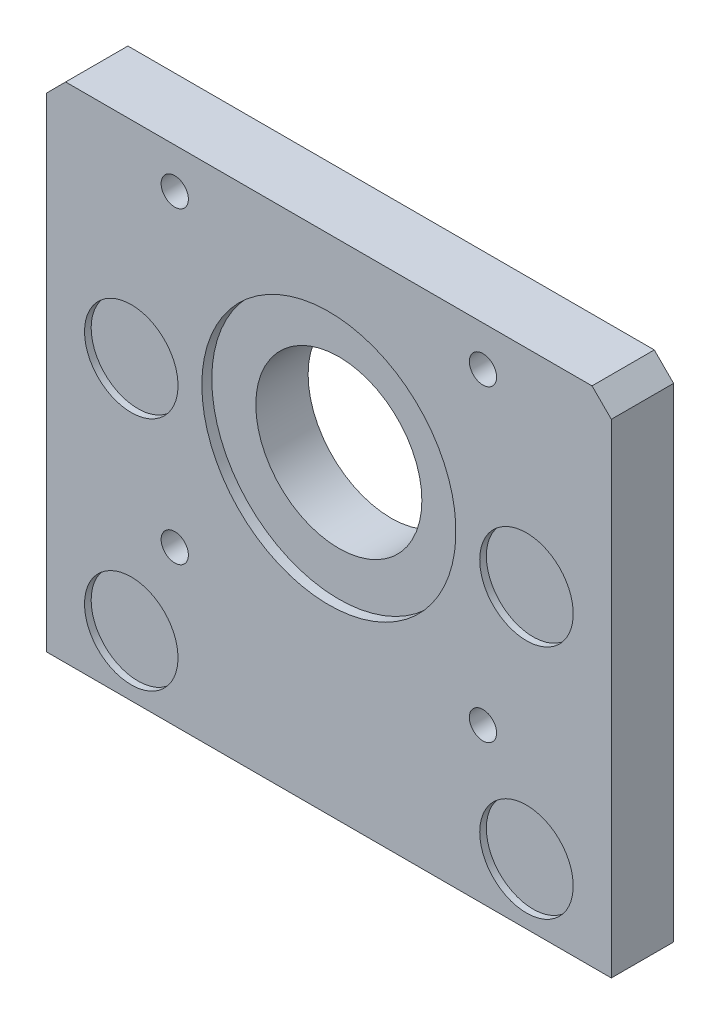
ISO-10303-21;
HEADER;
FILE_DESCRIPTION(('STEP AP214'),'2;1');
FILE_NAME('part.step','',(''),(''),'','','');
FILE_SCHEMA(('AUTOMOTIVE_DESIGN { 1 0 10303 214 1 1 1 1 }'));
ENDSEC;
DATA;
#1=APPLICATION_CONTEXT('core data for automotive mechanical design processes');
#2=APPLICATION_PROTOCOL_DEFINITION('international standard','automotive_design',2000,#1);
#3=PRODUCT_CONTEXT('',#1,'mechanical');
#4=PRODUCT('Part','Part','',(#3));
#5=PRODUCT_RELATED_PRODUCT_CATEGORY('part','',(#4));
#6=PRODUCT_DEFINITION_FORMATION('','',#4);
#7=PRODUCT_DEFINITION_CONTEXT('part definition',#1,'design');
#8=PRODUCT_DEFINITION('design','',#6,#7);
#9=PRODUCT_DEFINITION_SHAPE('','',#8);
#10=(LENGTH_UNIT() NAMED_UNIT(*) SI_UNIT(.MILLI.,.METRE.));
#11=(NAMED_UNIT(*) PLANE_ANGLE_UNIT() SI_UNIT($,.RADIAN.));
#12=(NAMED_UNIT(*) SI_UNIT($,.STERADIAN.) SOLID_ANGLE_UNIT());
#13=UNCERTAINTY_MEASURE_WITH_UNIT(LENGTH_MEASURE(1.E-05),#10,'distance_accuracy_value','');
#14=(GEOMETRIC_REPRESENTATION_CONTEXT(3) GLOBAL_UNCERTAINTY_ASSIGNED_CONTEXT((#13)) GLOBAL_UNIT_ASSIGNED_CONTEXT((#10,
#11,#12)) REPRESENTATION_CONTEXT('',''));
#15=CARTESIAN_POINT('',(0.,0.,0.));
#16=DIRECTION('',(0.,0.,1.));
#17=DIRECTION('',(1.,0.,0.));
#18=AXIS2_PLACEMENT_3D('',#15,#16,#17);
#19=CARTESIAN_POINT('',(30.226001739502,-18.0340015888214,8.509));
#20=DIRECTION('',(0.,0.,1.));
#21=DIRECTION('',(1.,0.,0.));
#22=AXIS2_PLACEMENT_3D('',#19,#20,#21);
#23=PLANE('',#22);
#24=CARTESIAN_POINT('',(30.226001739502,-18.0340015888214,8.509));
#25=DIRECTION('',(0.,0.,-1.));
#26=DIRECTION('',(-1.,0.,0.));
#27=AXIS2_PLACEMENT_3D('',#24,#25,#26);
#28=CIRCLE('',#27,7.1501);
#29=CARTESIAN_POINT('',(23.075901739502,-18.0340015888214,8.509));
#30=VERTEX_POINT('',#29);
#31=EDGE_CURVE('E19',#30,#30,#28,.F.);
#32=ORIENTED_EDGE('',*,*,#31,.T.);
#33=EDGE_LOOP('',(#32));
#34=FACE_BOUND('',#33,.T.);
#35=ADVANCED_FACE('F16',(#34),#23,.T.);
#36=CARTESIAN_POINT('',(30.226001739502,18.0340015888214,8.509));
#37=DIRECTION('',(0.,0.,1.));
#38=DIRECTION('',(1.,0.,0.));
#39=AXIS2_PLACEMENT_3D('',#36,#37,#38);
#40=PLANE('',#39);
#41=CARTESIAN_POINT('',(30.226001739502,18.0340015888214,8.509));
#42=DIRECTION('',(0.,0.,-1.));
#43=DIRECTION('',(-1.,0.,0.));
#44=AXIS2_PLACEMENT_3D('',#41,#42,#43);
#45=CIRCLE('',#44,7.1501);
#46=CARTESIAN_POINT('',(23.075901739502,18.0340015888214,8.509));
#47=VERTEX_POINT('',#46);
#48=EDGE_CURVE('E151',#47,#47,#45,.F.);
#49=ORIENTED_EDGE('',*,*,#48,.T.);
#50=EDGE_LOOP('',(#49));
#51=FACE_BOUND('',#50,.T.);
#52=ADVANCED_FACE('F245',(#51),#40,.T.);
#53=CARTESIAN_POINT('',(-30.2260023359813,-18.0340010436572,8.509));
#54=DIRECTION('',(0.,0.,1.));
#55=DIRECTION('',(1.,0.,0.));
#56=AXIS2_PLACEMENT_3D('',#53,#54,#55);
#57=PLANE('',#56);
#58=CARTESIAN_POINT('',(-30.2260023359813,-18.0340010436572,8.509));
#59=DIRECTION('',(0.,0.,-1.));
#60=DIRECTION('',(-1.,0.,0.));
#61=AXIS2_PLACEMENT_3D('',#58,#59,#60);
#62=CIRCLE('',#61,7.1501);
#63=CARTESIAN_POINT('',(-37.3761023359813,-18.0340010436572,8.509));
#64=VERTEX_POINT('',#63);
#65=EDGE_CURVE('E149',#64,#64,#62,.F.);
#66=ORIENTED_EDGE('',*,*,#65,.T.);
#67=EDGE_LOOP('',(#66));
#68=FACE_BOUND('',#67,.T.);
#69=ADVANCED_FACE('F243',(#68),#57,.T.);
#70=CARTESIAN_POINT('',(-30.2260023359813,18.0340010436575,8.509));
#71=DIRECTION('',(0.,0.,1.));
#72=DIRECTION('',(1.,0.,0.));
#73=AXIS2_PLACEMENT_3D('',#70,#71,#72);
#74=PLANE('',#73);
#75=CARTESIAN_POINT('',(-30.2260023359813,18.0340010436575,8.509));
#76=DIRECTION('',(0.,0.,-1.));
#77=DIRECTION('',(-1.,0.,0.));
#78=AXIS2_PLACEMENT_3D('',#75,#76,#77);
#79=CIRCLE('',#78,7.1501);
#80=CARTESIAN_POINT('',(-37.3761023359813,18.0340010436575,8.509));
#81=VERTEX_POINT('',#80);
#82=EDGE_CURVE('E146',#81,#81,#79,.F.);
#83=ORIENTED_EDGE('',*,*,#82,.T.);
#84=EDGE_LOOP('',(#83));
#85=FACE_BOUND('',#84,.T.);
#86=ADVANCED_FACE('F173',(#85),#74,.T.);
#87=CARTESIAN_POINT('',(0.,19.9408457428421,9.525));
#88=DIRECTION('',(0.,0.,-1.));
#89=DIRECTION('',(-1.,0.,0.));
#90=AXIS2_PLACEMENT_3D('',#87,#88,#89);
#91=CYLINDRICAL_SURFACE('',#90,19.431);
#92=CARTESIAN_POINT('',(0.,19.9408457428421,9.525));
#93=DIRECTION('',(0.,0.,-1.));
#94=DIRECTION('',(-1.,0.,0.));
#95=AXIS2_PLACEMENT_3D('',#92,#93,#94);
#96=CIRCLE('',#95,19.431);
#97=CARTESIAN_POINT('',(-19.431,19.9408457428421,9.525));
#98=VERTEX_POINT('',#97);
#99=EDGE_CURVE('E140',#98,#98,#96,.T.);
#100=ORIENTED_EDGE('',*,*,#99,.F.);
#101=EDGE_LOOP('',(#100));
#102=FACE_BOUND('',#101,.T.);
#103=CARTESIAN_POINT('',(0.,19.9408457428421,8.001));
#104=DIRECTION('',(0.,0.,-1.));
#105=DIRECTION('',(-1.,0.,0.));
#106=AXIS2_PLACEMENT_3D('',#103,#104,#105);
#107=CIRCLE('',#106,19.431);
#108=CARTESIAN_POINT('',(-19.431,19.9408457428421,8.001));
#109=VERTEX_POINT('',#108);
#110=EDGE_CURVE('E143',#109,#109,#107,.T.);
#111=ORIENTED_EDGE('',*,*,#110,.T.);
#112=EDGE_LOOP('',(#111));
#113=FACE_BOUND('',#112,.T.);
#114=ADVANCED_FACE('F162',(#102,#113),#91,.F.);
#115=CARTESIAN_POINT('',(30.226001739502,-18.0340015888214,9.525));
#116=DIRECTION('',(0.,0.,-1.));
#117=DIRECTION('',(-1.,0.,0.));
#118=AXIS2_PLACEMENT_3D('',#115,#116,#117);
#119=CYLINDRICAL_SURFACE('',#118,7.1501);
#120=CARTESIAN_POINT('',(30.226001739502,-18.0340015888214,9.525));
#121=DIRECTION('',(0.,0.,-1.));
#122=DIRECTION('',(-1.,0.,0.));
#123=AXIS2_PLACEMENT_3D('',#120,#121,#122);
#124=CIRCLE('',#123,7.1501);
#125=CARTESIAN_POINT('',(23.075901739502,-18.0340015888214,9.525));
#126=VERTEX_POINT('',#125);
#127=EDGE_CURVE('E137',#126,#126,#124,.T.);
#128=ORIENTED_EDGE('',*,*,#127,.F.);
#129=EDGE_LOOP('',(#128));
#130=FACE_BOUND('',#129,.T.);
#131=ORIENTED_EDGE('',*,*,#31,.F.);
#132=EDGE_LOOP('',(#131));
#133=FACE_BOUND('',#132,.T.);
#134=ADVANCED_FACE('F159',(#130,#133),#119,.F.);
#135=CARTESIAN_POINT('',(30.226001739502,18.0340015888214,9.525));
#136=DIRECTION('',(0.,0.,-1.));
#137=DIRECTION('',(-1.,0.,0.));
#138=AXIS2_PLACEMENT_3D('',#135,#136,#137);
#139=CYLINDRICAL_SURFACE('',#138,7.1501);
#140=CARTESIAN_POINT('',(30.226001739502,18.0340015888214,9.525));
#141=DIRECTION('',(0.,0.,-1.));
#142=DIRECTION('',(-1.,0.,0.));
#143=AXIS2_PLACEMENT_3D('',#140,#141,#142);
#144=CIRCLE('',#143,7.1501);
#145=CARTESIAN_POINT('',(23.075901739502,18.0340015888214,9.525));
#146=VERTEX_POINT('',#145);
#147=EDGE_CURVE('E134',#146,#146,#144,.T.);
#148=ORIENTED_EDGE('',*,*,#147,.F.);
#149=EDGE_LOOP('',(#148));
#150=FACE_BOUND('',#149,.T.);
#151=ORIENTED_EDGE('',*,*,#48,.F.);
#152=EDGE_LOOP('',(#151));
#153=FACE_BOUND('',#152,.T.);
#154=ADVANCED_FACE('F161',(#150,#153),#139,.F.);
#155=CARTESIAN_POINT('',(-30.2260023359813,-18.0340010436572,9.525));
#156=DIRECTION('',(0.,0.,-1.));
#157=DIRECTION('',(-1.,0.,0.));
#158=AXIS2_PLACEMENT_3D('',#155,#156,#157);
#159=CYLINDRICAL_SURFACE('',#158,7.1501);
#160=CARTESIAN_POINT('',(-30.2260023359813,-18.0340010436572,9.525));
#161=DIRECTION('',(0.,0.,-1.));
#162=DIRECTION('',(-1.,0.,0.));
#163=AXIS2_PLACEMENT_3D('',#160,#161,#162);
#164=CIRCLE('',#163,7.1501);
#165=CARTESIAN_POINT('',(-37.3761023359813,-18.0340010436572,9.525));
#166=VERTEX_POINT('',#165);
#167=EDGE_CURVE('E131',#166,#166,#164,.T.);
#168=ORIENTED_EDGE('',*,*,#167,.F.);
#169=EDGE_LOOP('',(#168));
#170=FACE_BOUND('',#169,.T.);
#171=ORIENTED_EDGE('',*,*,#65,.F.);
#172=EDGE_LOOP('',(#171));
#173=FACE_BOUND('',#172,.T.);
#174=ADVANCED_FACE('F170',(#170,#173),#159,.F.);
#175=CARTESIAN_POINT('',(-30.2260023359813,18.0340010436575,9.525));
#176=DIRECTION('',(0.,0.,-1.));
#177=DIRECTION('',(-1.,0.,0.));
#178=AXIS2_PLACEMENT_3D('',#175,#176,#177);
#179=CYLINDRICAL_SURFACE('',#178,7.1501);
#180=CARTESIAN_POINT('',(-30.2260023359813,18.0340010436575,9.525));
#181=DIRECTION('',(0.,0.,-1.));
#182=DIRECTION('',(-1.,0.,0.));
#183=AXIS2_PLACEMENT_3D('',#180,#181,#182);
#184=CIRCLE('',#183,7.1501);
#185=CARTESIAN_POINT('',(-37.3761023359813,18.0340010436575,9.525));
#186=VERTEX_POINT('',#185);
#187=EDGE_CURVE('E128',#186,#186,#184,.T.);
#188=ORIENTED_EDGE('',*,*,#187,.F.);
#189=EDGE_LOOP('',(#188));
#190=FACE_BOUND('',#189,.T.);
#191=ORIENTED_EDGE('',*,*,#82,.F.);
#192=EDGE_LOOP('',(#191));
#193=FACE_BOUND('',#192,.T.);
#194=ADVANCED_FACE('F230',(#190,#193),#179,.F.);
#195=CARTESIAN_POINT('',(0.,19.9408457428421,8.001));
#196=DIRECTION('',(0.,0.,-1.));
#197=DIRECTION('',(-1.,0.,0.));
#198=AXIS2_PLACEMENT_3D('',#195,#196,#197);
#199=PLANE('',#198);
#200=ORIENTED_EDGE('',*,*,#110,.F.);
#201=EDGE_LOOP('',(#200));
#202=FACE_BOUND('',#201,.T.);
#203=CARTESIAN_POINT('',(0.,19.9408457428421,8.001));
#204=DIRECTION('',(0.,0.,-1.));
#205=DIRECTION('',(-1.,0.,0.));
#206=AXIS2_PLACEMENT_3D('',#203,#204,#205);
#207=CIRCLE('',#206,12.7);
#208=CARTESIAN_POINT('',(-12.7,19.9408457428421,8.001));
#209=VERTEX_POINT('',#208);
#210=EDGE_CURVE('E89',#209,#209,#207,.T.);
#211=ORIENTED_EDGE('',*,*,#210,.T.);
#212=EDGE_LOOP('',(#211));
#213=FACE_BOUND('',#212,.T.);
#214=ADVANCED_FACE('F226',(#202,#213),#199,.F.);
#215=CARTESIAN_POINT('',(-0.00046993841071194,10.755760059879,9.525));
#216=DIRECTION('',(0.,0.,1.));
#217=DIRECTION('',(1.,0.,0.));
#218=AXIS2_PLACEMENT_3D('',#215,#216,#217);
#219=PLANE('',#218);
#220=ORIENTED_EDGE('',*,*,#187,.T.);
#221=EDGE_LOOP('',(#220));
#222=FACE_BOUND('',#221,.T.);
#223=ORIENTED_EDGE('',*,*,#167,.T.);
#224=EDGE_LOOP('',(#223));
#225=FACE_BOUND('',#224,.T.);
#226=ORIENTED_EDGE('',*,*,#147,.T.);
#227=EDGE_LOOP('',(#226));
#228=FACE_BOUND('',#227,.T.);
#229=ORIENTED_EDGE('',*,*,#127,.T.);
#230=EDGE_LOOP('',(#229));
#231=FACE_BOUND('',#230,.T.);
#232=DIRECTION('',(-0.705688297333315,-0.708522425196837,0.));
#233=VECTOR('',#232,1.);
#234=CARTESIAN_POINT('',(-43.2054,46.7072131003762,9.525));
#235=LINE('',#234,#233);
#236=CARTESIAN_POINT('',(-43.2054,46.7072131003762,9.525));
#237=VERTEX_POINT('',#236);
#238=CARTESIAN_POINT('',(-40.2649046888867,49.6595177892634,9.525));
#239=VERTEX_POINT('',#238);
#240=EDGE_CURVE('E65',#237,#239,#235,.F.);
#241=ORIENTED_EDGE('',*,*,#240,.F.);
#242=DIRECTION('',(0.,1.,0.));
#243=VECTOR('',#242,1.);
#244=CARTESIAN_POINT('',(-43.2054,-27.3031542571579,9.525));
#245=LINE('',#244,#243);
#246=CARTESIAN_POINT('',(-43.2054,-27.3031542571579,9.525));
#247=VERTEX_POINT('',#246);
#248=EDGE_CURVE('E447',#247,#237,#245,.T.);
#249=ORIENTED_EDGE('',*,*,#248,.F.);
#250=DIRECTION('',(1.,0.,0.));
#251=VECTOR('',#250,1.);
#252=CARTESIAN_POINT('',(43.2054,-27.3031542571579,9.525));
#253=LINE('',#252,#251);
#254=CARTESIAN_POINT('',(43.2054,-27.3031542571579,9.525));
#255=VERTEX_POINT('',#254);
#256=EDGE_CURVE('E444',#255,#247,#253,.F.);
#257=ORIENTED_EDGE('',*,*,#256,.F.);
#258=DIRECTION('',(0.,1.,0.));
#259=VECTOR('',#258,1.);
#260=CARTESIAN_POINT('',(43.2054,46.7072131003767,9.525));
#261=LINE('',#260,#259);
#262=CARTESIAN_POINT('',(43.2054,46.7072131003767,9.525));
#263=VERTEX_POINT('',#262);
#264=EDGE_CURVE('E85',#263,#255,#261,.F.);
#265=ORIENTED_EDGE('',*,*,#264,.F.);
#266=DIRECTION('',(-0.707106781186585,0.70710678118651,0.));
#267=VECTOR('',#266,1.);
#268=CARTESIAN_POINT('',(40.2530953111129,49.6595177892634,9.525));
#269=LINE('',#268,#267);
#270=CARTESIAN_POINT('',(40.2530953111129,49.6595177892634,9.525));
#271=VERTEX_POINT('',#270);
#272=EDGE_CURVE('E79',#271,#263,#269,.F.);
#273=ORIENTED_EDGE('',*,*,#272,.F.);
#274=DIRECTION('',(1.,0.,0.));
#275=VECTOR('',#274,1.);
#276=CARTESIAN_POINT('',(-40.2649046888867,49.6595177892634,9.525));
#277=LINE('',#276,#275);
#278=EDGE_CURVE('E70',#239,#271,#277,.T.);
#279=ORIENTED_EDGE('',*,*,#278,.F.);
#280=EDGE_LOOP('',(#241,#249,#257,#265,#273,#279));
#281=FACE_BOUND('',#280,.T.);
#282=ORIENTED_EDGE('',*,*,#99,.T.);
#283=EDGE_LOOP('',(#282));
#284=FACE_BOUND('',#283,.T.);
#285=CARTESIAN_POINT('',(23.5712,-3.63035425715801,9.525));
#286=DIRECTION('',(0.,0.,-1.));
#287=DIRECTION('',(-1.,0.,0.));
#288=AXIS2_PLACEMENT_3D('',#285,#286,#287);
#289=CIRCLE('',#288,2.0828);
#290=CARTESIAN_POINT('',(21.4884,-3.63035425715801,9.525));
#291=VERTEX_POINT('',#290);
#292=EDGE_CURVE('E116',#291,#291,#289,.T.);
#293=ORIENTED_EDGE('',*,*,#292,.T.);
#294=EDGE_LOOP('',(#293));
#295=FACE_BOUND('',#294,.T.);
#296=CARTESIAN_POINT('',(-23.5712,-3.63035425715801,9.525));
#297=DIRECTION('',(0.,0.,-1.));
#298=DIRECTION('',(-1.,0.,0.));
#299=AXIS2_PLACEMENT_3D('',#296,#297,#298);
#300=CIRCLE('',#299,2.0828);
#301=CARTESIAN_POINT('',(-25.654,-3.63035425715801,9.525));
#302=VERTEX_POINT('',#301);
#303=EDGE_CURVE('E119',#302,#302,#300,.T.);
#304=ORIENTED_EDGE('',*,*,#303,.T.);
#305=EDGE_LOOP('',(#304));
#306=FACE_BOUND('',#305,.T.);
#307=CARTESIAN_POINT('',(23.5712,43.512045742842,9.525));
#308=DIRECTION('',(0.,0.,-1.));
#309=DIRECTION('',(-1.,0.,0.));
#310=AXIS2_PLACEMENT_3D('',#307,#308,#309);
#311=CIRCLE('',#310,2.0828);
#312=CARTESIAN_POINT('',(21.4884,43.512045742842,9.525));
#313=VERTEX_POINT('',#312);
#314=EDGE_CURVE('E122',#313,#313,#311,.T.);
#315=ORIENTED_EDGE('',*,*,#314,.T.);
#316=EDGE_LOOP('',(#315));
#317=FACE_BOUND('',#316,.T.);
#318=CARTESIAN_POINT('',(-23.5712,43.512045742842,9.525));
#319=DIRECTION('',(0.,0.,-1.));
#320=DIRECTION('',(-1.,0.,0.));
#321=AXIS2_PLACEMENT_3D('',#318,#319,#320);
#322=CIRCLE('',#321,2.0828);
#323=CARTESIAN_POINT('',(-25.654,43.512045742842,9.525));
#324=VERTEX_POINT('',#323);
#325=EDGE_CURVE('E125',#324,#324,#322,.T.);
#326=ORIENTED_EDGE('',*,*,#325,.T.);
#327=EDGE_LOOP('',(#326));
#328=FACE_BOUND('',#327,.T.);
#329=ADVANCED_FACE('F82',(#222,#225,#228,#231,#281,#284,#295,#306,#317,#328),#219,.T.);
#330=CARTESIAN_POINT('',(-23.5712,43.512045742842,9.525));
#331=DIRECTION('',(0.,0.,-1.));
#332=DIRECTION('',(-1.,0.,0.));
#333=AXIS2_PLACEMENT_3D('',#330,#331,#332);
#334=CYLINDRICAL_SURFACE('',#333,2.0828);
#335=ORIENTED_EDGE('',*,*,#325,.F.);
#336=EDGE_LOOP('',(#335));
#337=FACE_BOUND('',#336,.T.);
#338=CARTESIAN_POINT('',(-23.5712,43.512045742842,0.));
#339=DIRECTION('',(0.,0.,-1.));
#340=DIRECTION('',(-1.,0.,0.));
#341=AXIS2_PLACEMENT_3D('',#338,#339,#340);
#342=CIRCLE('',#341,2.0828);
#343=CARTESIAN_POINT('',(-25.654,43.512045742842,0.));
#344=VERTEX_POINT('',#343);
#345=EDGE_CURVE('E110',#344,#344,#342,.T.);
#346=ORIENTED_EDGE('',*,*,#345,.T.);
#347=EDGE_LOOP('',(#346));
#348=FACE_BOUND('',#347,.T.);
#349=ADVANCED_FACE('F219',(#337,#348),#334,.F.);
#350=CARTESIAN_POINT('',(23.5712,43.512045742842,9.525));
#351=DIRECTION('',(0.,0.,-1.));
#352=DIRECTION('',(-1.,0.,0.));
#353=AXIS2_PLACEMENT_3D('',#350,#351,#352);
#354=CYLINDRICAL_SURFACE('',#353,2.0828);
#355=ORIENTED_EDGE('',*,*,#314,.F.);
#356=EDGE_LOOP('',(#355));
#357=FACE_BOUND('',#356,.T.);
#358=CARTESIAN_POINT('',(23.5712,43.512045742842,0.));
#359=DIRECTION('',(0.,0.,-1.));
#360=DIRECTION('',(-1.,0.,0.));
#361=AXIS2_PLACEMENT_3D('',#358,#359,#360);
#362=CIRCLE('',#361,2.0828);
#363=CARTESIAN_POINT('',(21.4884,43.512045742842,0.));
#364=VERTEX_POINT('',#363);
#365=EDGE_CURVE('E107',#364,#364,#362,.T.);
#366=ORIENTED_EDGE('',*,*,#365,.T.);
#367=EDGE_LOOP('',(#366));
#368=FACE_BOUND('',#367,.T.);
#369=ADVANCED_FACE('F215',(#357,#368),#354,.F.);
#370=CARTESIAN_POINT('',(-23.5712,-3.63035425715801,9.525));
#371=DIRECTION('',(0.,0.,-1.));
#372=DIRECTION('',(-1.,0.,0.));
#373=AXIS2_PLACEMENT_3D('',#370,#371,#372);
#374=CYLINDRICAL_SURFACE('',#373,2.0828);
#375=ORIENTED_EDGE('',*,*,#303,.F.);
#376=EDGE_LOOP('',(#375));
#377=FACE_BOUND('',#376,.T.);
#378=CARTESIAN_POINT('',(-23.5712,-3.63035425715801,0.));
#379=DIRECTION('',(0.,0.,-1.));
#380=DIRECTION('',(-1.,0.,0.));
#381=AXIS2_PLACEMENT_3D('',#378,#379,#380);
#382=CIRCLE('',#381,2.0828);
#383=CARTESIAN_POINT('',(-25.654,-3.63035425715801,0.));
#384=VERTEX_POINT('',#383);
#385=EDGE_CURVE('E104',#384,#384,#382,.T.);
#386=ORIENTED_EDGE('',*,*,#385,.T.);
#387=EDGE_LOOP('',(#386));
#388=FACE_BOUND('',#387,.T.);
#389=ADVANCED_FACE('F211',(#377,#388),#374,.F.);
#390=CARTESIAN_POINT('',(23.5712,-3.63035425715801,9.525));
#391=DIRECTION('',(0.,0.,-1.));
#392=DIRECTION('',(-1.,0.,0.));
#393=AXIS2_PLACEMENT_3D('',#390,#391,#392);
#394=CYLINDRICAL_SURFACE('',#393,2.0828);
#395=ORIENTED_EDGE('',*,*,#292,.F.);
#396=EDGE_LOOP('',(#395));
#397=FACE_BOUND('',#396,.T.);
#398=CARTESIAN_POINT('',(23.5712,-3.63035425715801,0.));
#399=DIRECTION('',(0.,0.,-1.));
#400=DIRECTION('',(-1.,0.,0.));
#401=AXIS2_PLACEMENT_3D('',#398,#399,#400);
#402=CIRCLE('',#401,2.0828);
#403=CARTESIAN_POINT('',(21.4884,-3.63035425715801,0.));
#404=VERTEX_POINT('',#403);
#405=EDGE_CURVE('E101',#404,#404,#402,.T.);
#406=ORIENTED_EDGE('',*,*,#405,.T.);
#407=EDGE_LOOP('',(#406));
#408=FACE_BOUND('',#407,.T.);
#409=ADVANCED_FACE('F207',(#397,#408),#394,.F.);
#410=CARTESIAN_POINT('',(0.,19.9408457428421,9.525));
#411=DIRECTION('',(0.,0.,-1.));
#412=DIRECTION('',(-1.,0.,0.));
#413=AXIS2_PLACEMENT_3D('',#410,#411,#412);
#414=CYLINDRICAL_SURFACE('',#413,12.7);
#415=CARTESIAN_POINT('',(0.,19.9408457428421,0.));
#416=DIRECTION('',(0.,0.,-1.));
#417=DIRECTION('',(-1.,0.,0.));
#418=AXIS2_PLACEMENT_3D('',#415,#416,#417);
#419=CIRCLE('',#418,12.7);
#420=CARTESIAN_POINT('',(-12.7,19.9408457428421,0.));
#421=VERTEX_POINT('',#420);
#422=EDGE_CURVE('E98',#421,#421,#419,.T.);
#423=ORIENTED_EDGE('',*,*,#422,.T.);
#424=EDGE_LOOP('',(#423));
#425=FACE_BOUND('',#424,.T.);
#426=ORIENTED_EDGE('',*,*,#210,.F.);
#427=EDGE_LOOP('',(#426));
#428=FACE_BOUND('',#427,.T.);
#429=ADVANCED_FACE('F204',(#425,#428),#414,.F.);
#430=CARTESIAN_POINT('',(40.2530953111129,49.6595177892634,0.));
#431=DIRECTION('',(0.70710678118651,0.707106781186585,0.));
#432=DIRECTION('',(-0.707106781186585,0.70710678118651,0.));
#433=AXIS2_PLACEMENT_3D('',#430,#431,#432);
#434=PLANE('',#433);
#435=DIRECTION('',(-0.707106781186596,0.707106781186499,0.));
#436=VECTOR('',#435,1.);
#437=CARTESIAN_POINT('',(43.2054,46.7072131003767,0.));
#438=LINE('',#437,#436);
#439=CARTESIAN_POINT('',(43.2054,46.7072131003767,0.));
#440=VERTEX_POINT('',#439);
#441=CARTESIAN_POINT('',(40.2530953111129,49.6595177892634,0.));
#442=VERTEX_POINT('',#441);
#443=EDGE_CURVE('E93',#440,#442,#438,.T.);
#444=ORIENTED_EDGE('',*,*,#443,.T.);
#445=DIRECTION('',(0.,0.,1.));
#446=VECTOR('',#445,1.);
#447=CARTESIAN_POINT('',(40.2530953111129,49.6595177892634,0.));
#448=LINE('',#447,#446);
#449=EDGE_CURVE('E75',#271,#442,#448,.F.);
#450=ORIENTED_EDGE('',*,*,#449,.F.);
#451=ORIENTED_EDGE('',*,*,#272,.T.);
#452=DIRECTION('',(0.,0.,-1.));
#453=VECTOR('',#452,1.);
#454=CARTESIAN_POINT('',(43.2054,46.7072131003767,0.));
#455=LINE('',#454,#453);
#456=EDGE_CURVE('E113',#440,#263,#455,.F.);
#457=ORIENTED_EDGE('',*,*,#456,.F.);
#458=EDGE_LOOP('',(#444,#450,#451,#457));
#459=FACE_BOUND('',#458,.T.);
#460=ADVANCED_FACE('F92',(#459),#434,.T.);
#461=CARTESIAN_POINT('',(-40.2649046888867,49.6595177892634,0.));
#462=DIRECTION('',(0.,1.,0.));
#463=DIRECTION('',(0.,0.,1.));
#464=AXIS2_PLACEMENT_3D('',#461,#462,#463);
#465=PLANE('',#464);
#466=DIRECTION('',(1.,0.,0.));
#467=VECTOR('',#466,1.);
#468=CARTESIAN_POINT('',(-0.00046993841071194,49.6595177892634,0.));
#469=LINE('',#468,#467);
#470=CARTESIAN_POINT('',(-40.2649046888867,49.6595177892634,0.));
#471=VERTEX_POINT('',#470);
#472=EDGE_CURVE('E431',#442,#471,#469,.F.);
#473=ORIENTED_EDGE('',*,*,#472,.T.);
#474=DIRECTION('',(0.,0.,1.));
#475=VECTOR('',#474,1.);
#476=CARTESIAN_POINT('',(-40.2649046888867,49.6595177892634,0.));
#477=LINE('',#476,#475);
#478=EDGE_CURVE('E77',#239,#471,#477,.F.);
#479=ORIENTED_EDGE('',*,*,#478,.F.);
#480=ORIENTED_EDGE('',*,*,#278,.T.);
#481=ORIENTED_EDGE('',*,*,#449,.T.);
#482=EDGE_LOOP('',(#473,#479,#480,#481));
#483=FACE_BOUND('',#482,.T.);
#484=ADVANCED_FACE('F73',(#483),#465,.T.);
#485=CARTESIAN_POINT('',(-43.2054,46.7072131003762,0.));
#486=DIRECTION('',(-0.708522425196837,0.705688297333315,0.));
#487=DIRECTION('',(-0.705688297333315,-0.708522425196837,0.));
#488=AXIS2_PLACEMENT_3D('',#485,#486,#487);
#489=PLANE('',#488);
#490=DIRECTION('',(-0.705688297333307,-0.708522425196844,0.));
#491=VECTOR('',#490,1.);
#492=CARTESIAN_POINT('',(-40.2649046888867,49.6595177892634,0.));
#493=LINE('',#492,#491);
#494=CARTESIAN_POINT('',(-43.2054,46.7072131003762,0.));
#495=VERTEX_POINT('',#494);
#496=EDGE_CURVE('E427',#471,#495,#493,.T.);
#497=ORIENTED_EDGE('',*,*,#496,.T.);
#498=DIRECTION('',(0.,0.,1.));
#499=VECTOR('',#498,1.);
#500=CARTESIAN_POINT('',(-43.2054,46.7072131003762,0.));
#501=LINE('',#500,#499);
#502=EDGE_CURVE('E428',#237,#495,#501,.F.);
#503=ORIENTED_EDGE('',*,*,#502,.F.);
#504=ORIENTED_EDGE('',*,*,#240,.T.);
#505=ORIENTED_EDGE('',*,*,#478,.T.);
#506=EDGE_LOOP('',(#497,#503,#504,#505));
#507=FACE_BOUND('',#506,.T.);
#508=ADVANCED_FACE('F196',(#507),#489,.T.);
#509=CARTESIAN_POINT('',(-43.2054,-27.3031542571579,0.));
#510=DIRECTION('',(-1.,0.,0.));
#511=DIRECTION('',(0.,0.,1.));
#512=AXIS2_PLACEMENT_3D('',#509,#510,#511);
#513=PLANE('',#512);
#514=DIRECTION('',(0.,1.,0.));
#515=VECTOR('',#514,1.);
#516=CARTESIAN_POINT('',(-43.2054,10.755760059879,0.));
#517=LINE('',#516,#515);
#518=CARTESIAN_POINT('',(-43.2054,-27.3031542571579,0.));
#519=VERTEX_POINT('',#518);
#520=EDGE_CURVE('E430',#495,#519,#517,.F.);
#521=ORIENTED_EDGE('',*,*,#520,.T.);
#522=DIRECTION('',(0.,0.,-1.));
#523=VECTOR('',#522,1.);
#524=CARTESIAN_POINT('',(-43.2054,-27.3031542571579,0.));
#525=LINE('',#524,#523);
#526=EDGE_CURVE('E442',#247,#519,#525,.T.);
#527=ORIENTED_EDGE('',*,*,#526,.F.);
#528=ORIENTED_EDGE('',*,*,#248,.T.);
#529=ORIENTED_EDGE('',*,*,#502,.T.);
#530=EDGE_LOOP('',(#521,#527,#528,#529));
#531=FACE_BOUND('',#530,.T.);
#532=ADVANCED_FACE('F192',(#531),#513,.T.);
#533=CARTESIAN_POINT('',(43.2054,-27.3031542571579,0.));
#534=DIRECTION('',(0.,-1.,0.));
#535=DIRECTION('',(0.,0.,-1.));
#536=AXIS2_PLACEMENT_3D('',#533,#534,#535);
#537=PLANE('',#536);
#538=DIRECTION('',(1.,0.,0.));
#539=VECTOR('',#538,1.);
#540=CARTESIAN_POINT('',(-0.00046993841071194,-27.3031542571579,0.));
#541=LINE('',#540,#539);
#542=CARTESIAN_POINT('',(43.2054,-27.3031542571579,0.));
#543=VERTEX_POINT('',#542);
#544=EDGE_CURVE('E25',#519,#543,#541,.T.);
#545=ORIENTED_EDGE('',*,*,#544,.T.);
#546=DIRECTION('',(0.,0.,-1.));
#547=VECTOR('',#546,1.);
#548=CARTESIAN_POINT('',(43.2054,-27.3031542571579,0.));
#549=LINE('',#548,#547);
#550=EDGE_CURVE('E33',#255,#543,#549,.T.);
#551=ORIENTED_EDGE('',*,*,#550,.F.);
#552=ORIENTED_EDGE('',*,*,#256,.T.);
#553=ORIENTED_EDGE('',*,*,#526,.T.);
#554=EDGE_LOOP('',(#545,#551,#552,#553));
#555=FACE_BOUND('',#554,.T.);
#556=ADVANCED_FACE('F185',(#555),#537,.T.);
#557=CARTESIAN_POINT('',(43.2054,46.7072131003767,0.));
#558=DIRECTION('',(1.,0.,0.));
#559=DIRECTION('',(0.,0.,-1.));
#560=AXIS2_PLACEMENT_3D('',#557,#558,#559);
#561=PLANE('',#560);
#562=DIRECTION('',(0.,1.,0.));
#563=VECTOR('',#562,1.);
#564=CARTESIAN_POINT('',(43.2054,10.755760059879,0.));
#565=LINE('',#564,#563);
#566=EDGE_CURVE('E11',#543,#440,#565,.T.);
#567=ORIENTED_EDGE('',*,*,#566,.T.);
#568=ORIENTED_EDGE('',*,*,#456,.T.);
#569=ORIENTED_EDGE('',*,*,#264,.T.);
#570=ORIENTED_EDGE('',*,*,#550,.T.);
#571=EDGE_LOOP('',(#567,#568,#569,#570));
#572=FACE_BOUND('',#571,.T.);
#573=ADVANCED_FACE('F179',(#572),#561,.T.);
#574=CARTESIAN_POINT('',(-0.00046993841071194,10.755760059879,0.));
#575=DIRECTION('',(0.,0.,1.));
#576=DIRECTION('',(1.,0.,0.));
#577=AXIS2_PLACEMENT_3D('',#574,#575,#576);
#578=PLANE('',#577);
#579=ORIENTED_EDGE('',*,*,#544,.F.);
#580=ORIENTED_EDGE('',*,*,#520,.F.);
#581=ORIENTED_EDGE('',*,*,#496,.F.);
#582=ORIENTED_EDGE('',*,*,#472,.F.);
#583=ORIENTED_EDGE('',*,*,#443,.F.);
#584=ORIENTED_EDGE('',*,*,#566,.F.);
#585=EDGE_LOOP('',(#579,#580,#581,#582,#583,#584));
#586=FACE_BOUND('',#585,.T.);
#587=ORIENTED_EDGE('',*,*,#422,.F.);
#588=EDGE_LOOP('',(#587));
#589=FACE_BOUND('',#588,.T.);
#590=ORIENTED_EDGE('',*,*,#405,.F.);
#591=EDGE_LOOP('',(#590));
#592=FACE_BOUND('',#591,.T.);
#593=ORIENTED_EDGE('',*,*,#385,.F.);
#594=EDGE_LOOP('',(#593));
#595=FACE_BOUND('',#594,.T.);
#596=ORIENTED_EDGE('',*,*,#365,.F.);
#597=EDGE_LOOP('',(#596));
#598=FACE_BOUND('',#597,.T.);
#599=ORIENTED_EDGE('',*,*,#345,.F.);
#600=EDGE_LOOP('',(#599));
#601=FACE_BOUND('',#600,.T.);
#602=ADVANCED_FACE('F177',(#586,#589,#592,#595,#598,#601),#578,.F.);
#603=CLOSED_SHELL('',(#35,#52,#69,#86,#114,#134,#154,#174,#194,#214,#329,#349,#369,#389,#409,
#429,#460,#484,#508,#532,#556,#573,#602));
#604=MANIFOLD_SOLID_BREP('B1',#603);
#605=ADVANCED_BREP_SHAPE_REPRESENTATION('',(#18,#604),#14);
#606=SHAPE_DEFINITION_REPRESENTATION(#9,#605);
ENDSEC;
END-ISO-10303-21;
